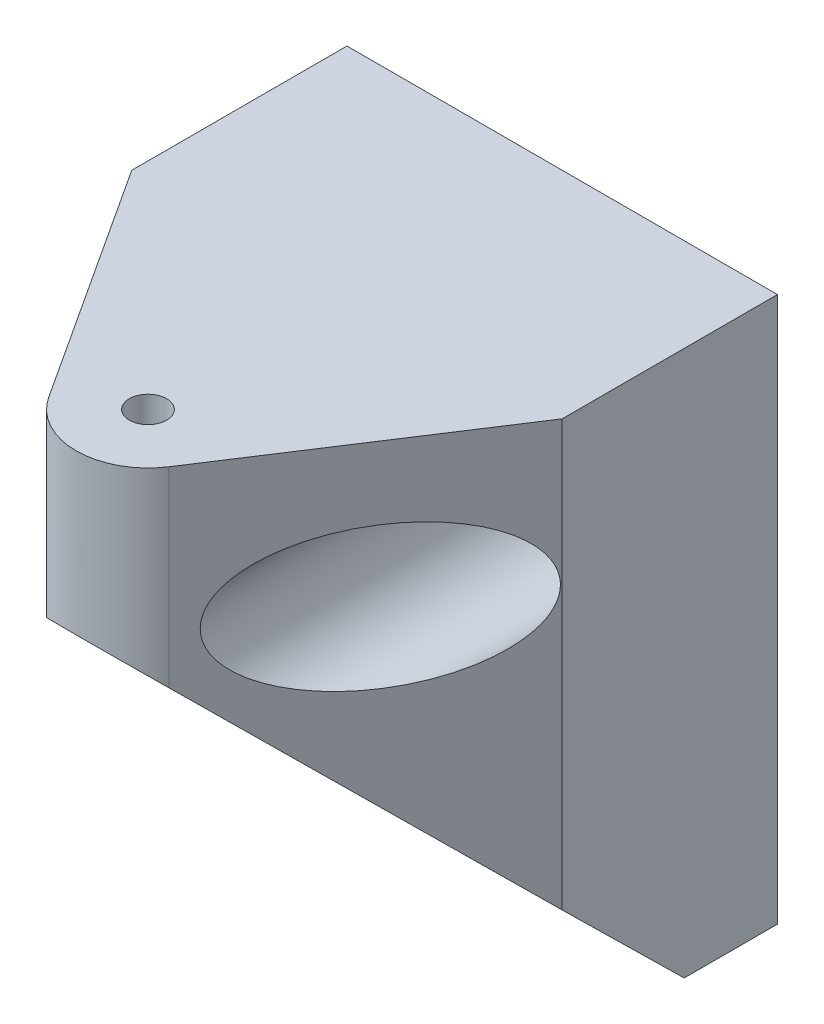
ISO-10303-21;
HEADER;
FILE_DESCRIPTION(('STEP AP214'),'2;1');
FILE_NAME('part.step','',(''),(''),'','','');
FILE_SCHEMA(('AUTOMOTIVE_DESIGN { 1 0 10303 214 1 1 1 1 }'));
ENDSEC;
DATA;
#1=APPLICATION_CONTEXT('core data for automotive mechanical design processes');
#2=APPLICATION_PROTOCOL_DEFINITION('international standard','automotive_design',2000,#1);
#3=PRODUCT_CONTEXT('',#1,'mechanical');
#4=PRODUCT('Part','Part','',(#3));
#5=PRODUCT_RELATED_PRODUCT_CATEGORY('part','',(#4));
#6=PRODUCT_DEFINITION_FORMATION('','',#4);
#7=PRODUCT_DEFINITION_CONTEXT('part definition',#1,'design');
#8=PRODUCT_DEFINITION('design','',#6,#7);
#9=PRODUCT_DEFINITION_SHAPE('','',#8);
#10=(LENGTH_UNIT() NAMED_UNIT(*) SI_UNIT(.MILLI.,.METRE.));
#11=(NAMED_UNIT(*) PLANE_ANGLE_UNIT() SI_UNIT($,.RADIAN.));
#12=(NAMED_UNIT(*) SI_UNIT($,.STERADIAN.) SOLID_ANGLE_UNIT());
#13=UNCERTAINTY_MEASURE_WITH_UNIT(LENGTH_MEASURE(1.E-05),#10,'distance_accuracy_value','');
#14=(GEOMETRIC_REPRESENTATION_CONTEXT(3) GLOBAL_UNCERTAINTY_ASSIGNED_CONTEXT((#13)) GLOBAL_UNIT_ASSIGNED_CONTEXT((#10,
#11,#12)) REPRESENTATION_CONTEXT('',''));
#15=CARTESIAN_POINT('',(0.,0.,0.));
#16=DIRECTION('',(0.,0.,1.));
#17=DIRECTION('',(1.,0.,0.));
#18=AXIS2_PLACEMENT_3D('',#15,#16,#17);
#19=CARTESIAN_POINT('',(30.,38.,0.));
#20=DIRECTION('',(0.,0.,1.));
#21=DIRECTION('',(0.,-1.,0.));
#22=AXIS2_PLACEMENT_3D('',#19,#20,#21);
#23=PLANE('',#22);
#24=CARTESIAN_POINT('',(5.,28.,0.));
#25=DIRECTION('',(0.,0.,-1.));
#26=DIRECTION('',(-1.,0.,0.));
#27=AXIS2_PLACEMENT_3D('',#24,#25,#26);
#28=CIRCLE('',#27,2.6);
#29=CARTESIAN_POINT('',(2.4,28.,0.));
#30=VERTEX_POINT('',#29);
#31=EDGE_CURVE('E175',#30,#30,#28,.T.);
#32=ORIENTED_EDGE('',*,*,#31,.F.);
#33=EDGE_LOOP('',(#32));
#34=FACE_BOUND('',#33,.T.);
#35=CARTESIAN_POINT('',(25.,28.,0.));
#36=DIRECTION('',(0.,0.,-1.));
#37=DIRECTION('',(-1.,0.,0.));
#38=AXIS2_PLACEMENT_3D('',#35,#36,#37);
#39=CIRCLE('',#38,2.6);
#40=CARTESIAN_POINT('',(22.4,28.,0.));
#41=VERTEX_POINT('',#40);
#42=EDGE_CURVE('E134',#41,#41,#39,.T.);
#43=ORIENTED_EDGE('',*,*,#42,.F.);
#44=EDGE_LOOP('',(#43));
#45=FACE_BOUND('',#44,.T.);
#46=DIRECTION('',(0.,1.,0.));
#47=VECTOR('',#46,1.);
#48=CARTESIAN_POINT('',(0.,38.,0.));
#49=LINE('',#48,#47);
#50=CARTESIAN_POINT('',(0.,0.,0.));
#51=VERTEX_POINT('',#50);
#52=CARTESIAN_POINT('',(0.,38.,0.));
#53=VERTEX_POINT('',#52);
#54=EDGE_CURVE('E130',#51,#53,#49,.T.);
#55=ORIENTED_EDGE('',*,*,#54,.T.);
#56=DIRECTION('',(-1.,0.,0.));
#57=VECTOR('',#56,1.);
#58=CARTESIAN_POINT('',(30.,38.,0.));
#59=LINE('',#58,#57);
#60=CARTESIAN_POINT('',(30.,38.,0.));
#61=VERTEX_POINT('',#60);
#62=EDGE_CURVE('E11',#61,#53,#59,.T.);
#63=ORIENTED_EDGE('',*,*,#62,.F.);
#64=DIRECTION('',(0.,1.,0.));
#65=VECTOR('',#64,1.);
#66=CARTESIAN_POINT('',(30.,38.,0.));
#67=LINE('',#66,#65);
#68=CARTESIAN_POINT('',(30.,0.,0.));
#69=VERTEX_POINT('',#68);
#70=EDGE_CURVE('E120',#69,#61,#67,.T.);
#71=ORIENTED_EDGE('',*,*,#70,.F.);
#72=DIRECTION('',(-1.,0.,0.));
#73=VECTOR('',#72,1.);
#74=CARTESIAN_POINT('',(30.,0.,0.));
#75=LINE('',#74,#73);
#76=EDGE_CURVE('E129',#69,#51,#75,.T.);
#77=ORIENTED_EDGE('',*,*,#76,.T.);
#78=EDGE_LOOP('',(#55,#63,#71,#77));
#79=FACE_BOUND('',#78,.T.);
#80=ADVANCED_FACE('F35',(#34,#45,#79),#23,.F.);
#81=CARTESIAN_POINT('',(30.,38.,35.));
#82=DIRECTION('',(0.,-1.,0.));
#83=DIRECTION('',(0.,0.,-1.));
#84=AXIS2_PLACEMENT_3D('',#81,#82,#83);
#85=PLANE('',#84);
#86=CARTESIAN_POINT('',(15.,38.,28.87));
#87=DIRECTION('',(0.,1.,0.));
#88=DIRECTION('',(0.,0.,1.));
#89=AXIS2_PLACEMENT_3D('',#86,#87,#88);
#90=CIRCLE('',#89,1.3);
#91=CARTESIAN_POINT('',(15.,38.,30.17));
#92=VERTEX_POINT('',#91);
#93=EDGE_CURVE('E156',#92,#92,#90,.T.);
#94=ORIENTED_EDGE('',*,*,#93,.F.);
#95=EDGE_LOOP('',(#94));
#96=FACE_BOUND('',#95,.T.);
#97=DIRECTION('',(0.,0.,1.));
#98=VECTOR('',#97,1.);
#99=CARTESIAN_POINT('',(0.,38.,35.));
#100=LINE('',#99,#98);
#101=CARTESIAN_POINT('',(0.,38.,15.));
#102=VERTEX_POINT('',#101);
#103=EDGE_CURVE('E133',#53,#102,#100,.T.);
#104=ORIENTED_EDGE('',*,*,#103,.T.);
#105=DIRECTION('',(-0.545735967256233,0.,-0.837957191056264));
#106=VECTOR('',#105,1.);
#107=CARTESIAN_POINT('',(10.8102140447187,38.,31.5986798362812));
#108=LINE('',#107,#106);
#109=CARTESIAN_POINT('',(10.8102140447187,38.,31.5986798362812));
#110=VERTEX_POINT('',#109);
#111=EDGE_CURVE('E49',#110,#102,#108,.T.);
#112=ORIENTED_EDGE('',*,*,#111,.F.);
#113=CARTESIAN_POINT('',(15.,38.,28.87));
#114=DIRECTION('',(0.,-1.,0.));
#115=DIRECTION('',(0.,0.,-1.));
#116=AXIS2_PLACEMENT_3D('',#113,#114,#115);
#117=CIRCLE('',#116,5.);
#118=CARTESIAN_POINT('',(19.1897859552813,38.,31.5986798362812));
#119=VERTEX_POINT('',#118);
#120=EDGE_CURVE('E115',#119,#110,#117,.T.);
#121=ORIENTED_EDGE('',*,*,#120,.F.);
#122=DIRECTION('',(-0.545735967256233,0.,0.837957191056264));
#123=VECTOR('',#122,1.);
#124=CARTESIAN_POINT('',(30.,38.,15.));
#125=LINE('',#124,#123);
#126=CARTESIAN_POINT('',(30.,38.,15.));
#127=VERTEX_POINT('',#126);
#128=EDGE_CURVE('E105',#127,#119,#125,.T.);
#129=ORIENTED_EDGE('',*,*,#128,.F.);
#130=DIRECTION('',(0.,0.,1.));
#131=VECTOR('',#130,1.);
#132=CARTESIAN_POINT('',(30.,38.,35.));
#133=LINE('',#132,#131);
#134=EDGE_CURVE('E81',#61,#127,#133,.T.);
#135=ORIENTED_EDGE('',*,*,#134,.F.);
#136=ORIENTED_EDGE('',*,*,#62,.T.);
#137=EDGE_LOOP('',(#104,#112,#121,#129,#135,#136));
#138=FACE_BOUND('',#137,.T.);
#139=ADVANCED_FACE('F113',(#96,#138),#85,.F.);
#140=CARTESIAN_POINT('',(30.,28.,35.));
#141=DIRECTION('',(0.,0.713336431514775,-0.700821757277674));
#142=DIRECTION('',(0.,0.700821757277674,0.713336431514775));
#143=AXIS2_PLACEMENT_3D('',#140,#141,#142);
#144=PLANE('',#143);
#145=CARTESIAN_POINT('',(15.,21.9775438596491,28.87));
#146=DIRECTION('',(0.,0.713336431514775,-0.700821757277674));
#147=DIRECTION('',(0.,0.700821757277674,0.713336431514775));
#148=AXIS2_PLACEMENT_3D('',#145,#146,#147);
#149=ELLIPSE('',#148,1.82242199131683,1.3);
#150=CARTESIAN_POINT('',(15.,23.2547368421053,30.17));
#151=VERTEX_POINT('',#150);
#152=EDGE_CURVE('E159',#151,#151,#149,.F.);
#153=ORIENTED_EDGE('',*,*,#152,.F.);
#154=EDGE_LOOP('',(#153));
#155=FACE_BOUND('',#154,.T.);
#156=CARTESIAN_POINT('',(15.,21.9775438596491,28.87));
#157=DIRECTION('',(0.,0.713336431514775,-0.700821757277674));
#158=DIRECTION('',(0.,0.700821757277674,0.713336431514775));
#159=AXIS2_PLACEMENT_3D('',#156,#157,#158);
#160=ELLIPSE('',#159,7.00931535121859,5.);
#161=CARTESIAN_POINT('',(10.8102140447187,24.6583521198552,31.5986798362812));
#162=VERTEX_POINT('',#161);
#163=CARTESIAN_POINT('',(19.1897859552813,24.6583521198552,31.5986798362812));
#164=VERTEX_POINT('',#163);
#165=EDGE_CURVE('E222',#162,#164,#160,.T.);
#166=ORIENTED_EDGE('',*,*,#165,.F.);
#167=DIRECTION('',(0.421326578391589,0.635581551366471,0.646931221926587));
#168=VECTOR('',#167,1.);
#169=CARTESIAN_POINT('',(4.20675024681792,14.6968638579842,21.4593078554482));
#170=LINE('',#169,#168);
#171=CARTESIAN_POINT('',(0.,8.35087719298246,15.));
#172=VERTEX_POINT('',#171);
#173=EDGE_CURVE('E116',#172,#162,#170,.T.);
#174=ORIENTED_EDGE('',*,*,#173,.F.);
#175=DIRECTION('',(0.,-0.700821757277674,-0.713336431514775));
#176=VECTOR('',#175,1.);
#177=CARTESIAN_POINT('',(0.,28.,35.));
#178=LINE('',#177,#176);
#179=CARTESIAN_POINT('',(0.,0.,6.5));
#180=VERTEX_POINT('',#179);
#181=EDGE_CURVE('E136',#172,#180,#178,.T.);
#182=ORIENTED_EDGE('',*,*,#181,.T.);
#183=DIRECTION('',(-1.,0.,0.));
#184=VECTOR('',#183,1.);
#185=CARTESIAN_POINT('',(30.,0.,6.5));
#186=LINE('',#185,#184);
#187=CARTESIAN_POINT('',(30.,0.,6.5));
#188=VERTEX_POINT('',#187);
#189=EDGE_CURVE('E42',#188,#180,#186,.T.);
#190=ORIENTED_EDGE('',*,*,#189,.F.);
#191=DIRECTION('',(0.,-0.700821757277674,-0.713336431514775));
#192=VECTOR('',#191,1.);
#193=CARTESIAN_POINT('',(30.,28.,35.));
#194=LINE('',#193,#192);
#195=CARTESIAN_POINT('',(30.,8.35087719298246,15.));
#196=VERTEX_POINT('',#195);
#197=EDGE_CURVE('E122',#196,#188,#194,.T.);
#198=ORIENTED_EDGE('',*,*,#197,.F.);
#199=DIRECTION('',(0.421326578391589,-0.635581551366471,-0.646931221926587));
#200=VECTOR('',#199,1.);
#201=CARTESIAN_POINT('',(32.2365274813512,4.977020239316,11.5658956007324));
#202=LINE('',#201,#200);
#203=EDGE_CURVE('E108',#164,#196,#202,.T.);
#204=ORIENTED_EDGE('',*,*,#203,.F.);
#205=EDGE_LOOP('',(#166,#174,#182,#190,#198,#204));
#206=FACE_BOUND('',#205,.T.);
#207=ADVANCED_FACE('F187',(#155,#206),#144,.F.);
#208=CARTESIAN_POINT('',(30.,0.,0.));
#209=DIRECTION('',(0.,1.,0.));
#210=DIRECTION('',(0.,0.,1.));
#211=AXIS2_PLACEMENT_3D('',#208,#209,#210);
#212=PLANE('',#211);
#213=DIRECTION('',(0.,0.,-1.));
#214=VECTOR('',#213,1.);
#215=CARTESIAN_POINT('',(0.,0.,0.));
#216=LINE('',#215,#214);
#217=EDGE_CURVE('E75',#180,#51,#216,.T.);
#218=ORIENTED_EDGE('',*,*,#217,.T.);
#219=ORIENTED_EDGE('',*,*,#76,.F.);
#220=DIRECTION('',(0.,0.,-1.));
#221=VECTOR('',#220,1.);
#222=CARTESIAN_POINT('',(30.,0.,0.));
#223=LINE('',#222,#221);
#224=EDGE_CURVE('E58',#188,#69,#223,.T.);
#225=ORIENTED_EDGE('',*,*,#224,.F.);
#226=ORIENTED_EDGE('',*,*,#189,.T.);
#227=EDGE_LOOP('',(#218,#219,#225,#226));
#228=FACE_BOUND('',#227,.T.);
#229=ADVANCED_FACE('F140',(#228),#212,.F.);
#230=CARTESIAN_POINT('',(30.,0.,0.));
#231=DIRECTION('',(-1.,0.,0.));
#232=DIRECTION('',(0.,0.,1.));
#233=AXIS2_PLACEMENT_3D('',#230,#231,#232);
#234=PLANE('',#233);
#235=ORIENTED_EDGE('',*,*,#134,.T.);
#236=DIRECTION('',(0.,1.,0.));
#237=VECTOR('',#236,1.);
#238=CARTESIAN_POINT('',(30.,-0.001000000000001,15.));
#239=LINE('',#238,#237);
#240=EDGE_CURVE('E103',#196,#127,#239,.T.);
#241=ORIENTED_EDGE('',*,*,#240,.F.);
#242=ORIENTED_EDGE('',*,*,#197,.T.);
#243=ORIENTED_EDGE('',*,*,#224,.T.);
#244=ORIENTED_EDGE('',*,*,#70,.T.);
#245=EDGE_LOOP('',(#235,#241,#242,#243,#244));
#246=FACE_BOUND('',#245,.T.);
#247=ADVANCED_FACE('F118',(#246),#234,.F.);
#248=CARTESIAN_POINT('',(0.,0.,0.));
#249=DIRECTION('',(-1.,0.,0.));
#250=DIRECTION('',(0.,0.,1.));
#251=AXIS2_PLACEMENT_3D('',#248,#249,#250);
#252=PLANE('',#251);
#253=DIRECTION('',(0.,1.,0.));
#254=VECTOR('',#253,1.);
#255=CARTESIAN_POINT('',(0.,-0.001000000000001,15.));
#256=LINE('',#255,#254);
#257=EDGE_CURVE('E150',#172,#102,#256,.T.);
#258=ORIENTED_EDGE('',*,*,#257,.T.);
#259=ORIENTED_EDGE('',*,*,#103,.F.);
#260=ORIENTED_EDGE('',*,*,#54,.F.);
#261=ORIENTED_EDGE('',*,*,#217,.F.);
#262=ORIENTED_EDGE('',*,*,#181,.F.);
#263=EDGE_LOOP('',(#258,#259,#260,#261,#262));
#264=FACE_BOUND('',#263,.T.);
#265=ADVANCED_FACE('F145',(#264),#252,.T.);
#266=CARTESIAN_POINT('',(25.,28.,35.001));
#267=DIRECTION('',(0.,0.,-1.));
#268=DIRECTION('',(-1.,0.,0.));
#269=AXIS2_PLACEMENT_3D('',#266,#267,#268);
#270=CYLINDRICAL_SURFACE('',#269,2.6);
#271=CARTESIAN_POINT('',(25.,28.,6.5));
#272=DIRECTION('',(0.,0.,-1.));
#273=DIRECTION('',(-1.,0.,0.));
#274=AXIS2_PLACEMENT_3D('',#271,#272,#273);
#275=CIRCLE('',#274,2.6);
#276=CARTESIAN_POINT('',(22.4,28.,6.5));
#277=VERTEX_POINT('',#276);
#278=EDGE_CURVE('E172',#277,#277,#275,.T.);
#279=ORIENTED_EDGE('',*,*,#278,.F.);
#280=EDGE_LOOP('',(#279));
#281=FACE_BOUND('',#280,.T.);
#282=ORIENTED_EDGE('',*,*,#42,.T.);
#283=EDGE_LOOP('',(#282));
#284=FACE_BOUND('',#283,.T.);
#285=ADVANCED_FACE('F180',(#281,#284),#270,.F.);
#286=CARTESIAN_POINT('',(5.,28.,35.001));
#287=DIRECTION('',(0.,0.,-1.));
#288=DIRECTION('',(-1.,0.,0.));
#289=AXIS2_PLACEMENT_3D('',#286,#287,#288);
#290=CYLINDRICAL_SURFACE('',#289,2.6);
#291=CARTESIAN_POINT('',(5.,28.,6.5));
#292=DIRECTION('',(0.,0.,-1.));
#293=DIRECTION('',(-1.,0.,0.));
#294=AXIS2_PLACEMENT_3D('',#291,#292,#293);
#295=CIRCLE('',#294,2.6);
#296=CARTESIAN_POINT('',(2.4,28.,6.5));
#297=VERTEX_POINT('',#296);
#298=EDGE_CURVE('E166',#297,#297,#295,.T.);
#299=ORIENTED_EDGE('',*,*,#298,.F.);
#300=EDGE_LOOP('',(#299));
#301=FACE_BOUND('',#300,.T.);
#302=ORIENTED_EDGE('',*,*,#31,.T.);
#303=EDGE_LOOP('',(#302));
#304=FACE_BOUND('',#303,.T.);
#305=ADVANCED_FACE('F191',(#301,#304),#290,.F.);
#306=CARTESIAN_POINT('',(25.,28.,35.001));
#307=DIRECTION('',(0.,0.,-1.));
#308=DIRECTION('',(-1.,0.,0.));
#309=AXIS2_PLACEMENT_3D('',#306,#307,#308);
#310=CYLINDRICAL_SURFACE('',#309,4.95);
#311=CARTESIAN_POINT('',(25.,28.,22.6773132185992));
#312=DIRECTION('',(-0.837957191056264,0.,-0.545735967256233));
#313=DIRECTION('',(0.545735967256233,0.,-0.837957191056264));
#314=AXIS2_PLACEMENT_3D('',#311,#312,#313);
#315=ELLIPSE('',#314,9.07032025923973,4.95);
#316=CARTESIAN_POINT('',(29.95,28.,15.076773132186));
#317=VERTEX_POINT('',#316);
#318=EDGE_CURVE('E152',#317,#317,#315,.T.);
#319=ORIENTED_EDGE('',*,*,#318,.F.);
#320=EDGE_LOOP('',(#319));
#321=FACE_BOUND('',#320,.T.);
#322=CARTESIAN_POINT('',(25.,28.,6.5));
#323=DIRECTION('',(0.,0.,-1.));
#324=DIRECTION('',(-1.,0.,0.));
#325=AXIS2_PLACEMENT_3D('',#322,#323,#324);
#326=CIRCLE('',#325,4.95);
#327=CARTESIAN_POINT('',(20.05,28.,6.5));
#328=VERTEX_POINT('',#327);
#329=EDGE_CURVE('E169',#328,#328,#326,.T.);
#330=ORIENTED_EDGE('',*,*,#329,.T.);
#331=EDGE_LOOP('',(#330));
#332=FACE_BOUND('',#331,.T.);
#333=ADVANCED_FACE('F193',(#321,#332),#310,.F.);
#334=CARTESIAN_POINT('',(25.,28.,6.5));
#335=DIRECTION('',(0.,0.,-1.));
#336=DIRECTION('',(-1.,0.,0.));
#337=AXIS2_PLACEMENT_3D('',#334,#335,#336);
#338=PLANE('',#337);
#339=ORIENTED_EDGE('',*,*,#329,.F.);
#340=EDGE_LOOP('',(#339));
#341=FACE_BOUND('',#340,.T.);
#342=ORIENTED_EDGE('',*,*,#278,.T.);
#343=EDGE_LOOP('',(#342));
#344=FACE_BOUND('',#343,.T.);
#345=ADVANCED_FACE('F200',(#341,#344),#338,.F.);
#346=CARTESIAN_POINT('',(5.,28.,35.001));
#347=DIRECTION('',(0.,0.,-1.));
#348=DIRECTION('',(-1.,0.,0.));
#349=AXIS2_PLACEMENT_3D('',#346,#347,#348);
#350=CYLINDRICAL_SURFACE('',#349,4.95);
#351=CARTESIAN_POINT('',(5.,28.,22.6773132185992));
#352=DIRECTION('',(0.837957191056264,0.,-0.545735967256233));
#353=DIRECTION('',(-0.545735967256233,0.,-0.837957191056264));
#354=AXIS2_PLACEMENT_3D('',#351,#352,#353);
#355=ELLIPSE('',#354,9.07032025923972,4.95);
#356=CARTESIAN_POINT('',(0.0499999999999988,28.,15.076773132186));
#357=VERTEX_POINT('',#356);
#358=EDGE_CURVE('E160',#357,#357,#355,.T.);
#359=ORIENTED_EDGE('',*,*,#358,.F.);
#360=EDGE_LOOP('',(#359));
#361=FACE_BOUND('',#360,.T.);
#362=CARTESIAN_POINT('',(5.,28.,6.5));
#363=DIRECTION('',(0.,0.,-1.));
#364=DIRECTION('',(-1.,0.,0.));
#365=AXIS2_PLACEMENT_3D('',#362,#363,#364);
#366=CIRCLE('',#365,4.95);
#367=CARTESIAN_POINT('',(0.0499999999999988,28.,6.5));
#368=VERTEX_POINT('',#367);
#369=EDGE_CURVE('E163',#368,#368,#366,.T.);
#370=ORIENTED_EDGE('',*,*,#369,.T.);
#371=EDGE_LOOP('',(#370));
#372=FACE_BOUND('',#371,.T.);
#373=ADVANCED_FACE('F236',(#361,#372),#350,.F.);
#374=CARTESIAN_POINT('',(5.,28.,6.5));
#375=DIRECTION('',(0.,0.,-1.));
#376=DIRECTION('',(-1.,0.,0.));
#377=AXIS2_PLACEMENT_3D('',#374,#375,#376);
#378=PLANE('',#377);
#379=ORIENTED_EDGE('',*,*,#369,.F.);
#380=EDGE_LOOP('',(#379));
#381=FACE_BOUND('',#380,.T.);
#382=ORIENTED_EDGE('',*,*,#298,.T.);
#383=EDGE_LOOP('',(#382));
#384=FACE_BOUND('',#383,.T.);
#385=ADVANCED_FACE('F239',(#381,#384),#378,.F.);
#386=CARTESIAN_POINT('',(15.,-0.001000000000001,28.87));
#387=DIRECTION('',(0.,1.,0.));
#388=DIRECTION('',(0.,0.,1.));
#389=AXIS2_PLACEMENT_3D('',#386,#387,#388);
#390=CYLINDRICAL_SURFACE('',#389,1.3);
#391=ORIENTED_EDGE('',*,*,#93,.T.);
#392=EDGE_LOOP('',(#391));
#393=FACE_BOUND('',#392,.T.);
#394=ORIENTED_EDGE('',*,*,#152,.T.);
#395=EDGE_LOOP('',(#394));
#396=FACE_BOUND('',#395,.T.);
#397=ADVANCED_FACE('F245',(#393,#396),#390,.F.);
#398=CARTESIAN_POINT('',(10.8102140447187,-0.001000000000001,31.5986798362812));
#399=DIRECTION('',(0.837957191056264,0.,-0.545735967256233));
#400=DIRECTION('',(-0.545735967256233,0.,-0.837957191056264));
#401=AXIS2_PLACEMENT_3D('',#398,#399,#400);
#402=PLANE('',#401);
#403=ORIENTED_EDGE('',*,*,#358,.T.);
#404=EDGE_LOOP('',(#403));
#405=FACE_BOUND('',#404,.T.);
#406=ORIENTED_EDGE('',*,*,#173,.T.);
#407=DIRECTION('',(0.,1.,0.));
#408=VECTOR('',#407,1.);
#409=CARTESIAN_POINT('',(10.8102140447187,-0.001000000000001,31.5986798362812));
#410=LINE('',#409,#408);
#411=EDGE_CURVE('E153',#162,#110,#410,.T.);
#412=ORIENTED_EDGE('',*,*,#411,.T.);
#413=ORIENTED_EDGE('',*,*,#111,.T.);
#414=ORIENTED_EDGE('',*,*,#257,.F.);
#415=EDGE_LOOP('',(#406,#412,#413,#414));
#416=FACE_BOUND('',#415,.T.);
#417=ADVANCED_FACE('F234',(#405,#416),#402,.F.);
#418=CARTESIAN_POINT('',(15.,-0.001000000000001,28.87));
#419=DIRECTION('',(0.,1.,0.));
#420=DIRECTION('',(0.,0.,1.));
#421=AXIS2_PLACEMENT_3D('',#418,#419,#420);
#422=CYLINDRICAL_SURFACE('',#421,5.);
#423=ORIENTED_EDGE('',*,*,#165,.T.);
#424=DIRECTION('',(0.,1.,0.));
#425=VECTOR('',#424,1.);
#426=CARTESIAN_POINT('',(19.1897859552813,-0.001000000000001,31.5986798362812));
#427=LINE('',#426,#425);
#428=EDGE_CURVE('E110',#164,#119,#427,.T.);
#429=ORIENTED_EDGE('',*,*,#428,.T.);
#430=ORIENTED_EDGE('',*,*,#120,.T.);
#431=ORIENTED_EDGE('',*,*,#411,.F.);
#432=EDGE_LOOP('',(#423,#429,#430,#431));
#433=FACE_BOUND('',#432,.T.);
#434=ADVANCED_FACE('F280',(#433),#422,.T.);
#435=CARTESIAN_POINT('',(30.,-0.001000000000001,15.));
#436=DIRECTION('',(-0.837957191056264,0.,-0.545735967256233));
#437=DIRECTION('',(-0.545735967256233,0.,0.837957191056264));
#438=AXIS2_PLACEMENT_3D('',#435,#436,#437);
#439=PLANE('',#438);
#440=ORIENTED_EDGE('',*,*,#318,.T.);
#441=EDGE_LOOP('',(#440));
#442=FACE_BOUND('',#441,.T.);
#443=ORIENTED_EDGE('',*,*,#203,.T.);
#444=ORIENTED_EDGE('',*,*,#240,.T.);
#445=ORIENTED_EDGE('',*,*,#128,.T.);
#446=ORIENTED_EDGE('',*,*,#428,.F.);
#447=EDGE_LOOP('',(#443,#444,#445,#446));
#448=FACE_BOUND('',#447,.T.);
#449=ADVANCED_FACE('F104',(#442,#448),#439,.F.);
#450=CLOSED_SHELL('',(#80,#139,#207,#229,#247,#265,#285,#305,#333,#345,#373,#385,#397,#417,#434,#449));
#451=MANIFOLD_SOLID_BREP('B2',#450);
#452=ADVANCED_BREP_SHAPE_REPRESENTATION('',(#18,#451),#14);
#453=SHAPE_DEFINITION_REPRESENTATION(#9,#452);
ENDSEC;
END-ISO-10303-21;
